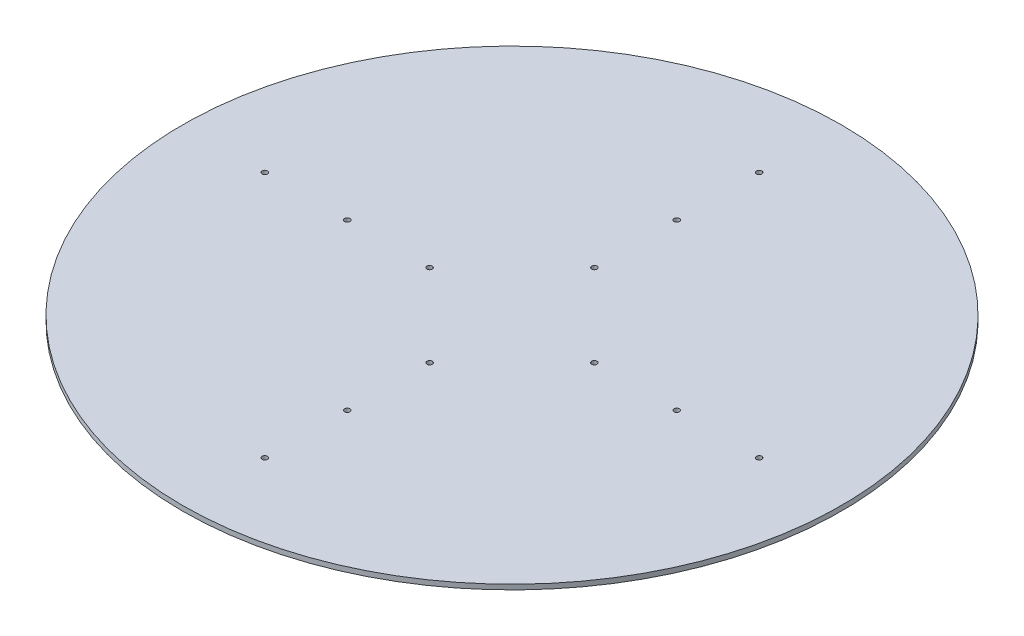
ISO-10303-21;
HEADER;
FILE_DESCRIPTION(('STEP AP214'),'2;1');
FILE_NAME('part.step','',(''),(''),'','','');
FILE_SCHEMA(('AUTOMOTIVE_DESIGN { 1 0 10303 214 1 1 1 1 }'));
ENDSEC;
DATA;
#1=APPLICATION_CONTEXT('core data for automotive mechanical design processes');
#2=APPLICATION_PROTOCOL_DEFINITION('international standard','automotive_design',2000,#1);
#3=PRODUCT_CONTEXT('',#1,'mechanical');
#4=PRODUCT('Part','Part','',(#3));
#5=PRODUCT_RELATED_PRODUCT_CATEGORY('part','',(#4));
#6=PRODUCT_DEFINITION_FORMATION('','',#4);
#7=PRODUCT_DEFINITION_CONTEXT('part definition',#1,'design');
#8=PRODUCT_DEFINITION('design','',#6,#7);
#9=PRODUCT_DEFINITION_SHAPE('','',#8);
#10=(LENGTH_UNIT() NAMED_UNIT(*) SI_UNIT(.MILLI.,.METRE.));
#11=(NAMED_UNIT(*) PLANE_ANGLE_UNIT() SI_UNIT($,.RADIAN.));
#12=(NAMED_UNIT(*) SI_UNIT($,.STERADIAN.) SOLID_ANGLE_UNIT());
#13=UNCERTAINTY_MEASURE_WITH_UNIT(LENGTH_MEASURE(1.E-05),#10,'distance_accuracy_value','');
#14=(GEOMETRIC_REPRESENTATION_CONTEXT(3) GLOBAL_UNCERTAINTY_ASSIGNED_CONTEXT((#13)) GLOBAL_UNIT_ASSIGNED_CONTEXT((#10,
#11,#12)) REPRESENTATION_CONTEXT('',''));
#15=CARTESIAN_POINT('',(0.,0.,0.));
#16=DIRECTION('',(0.,0.,1.));
#17=DIRECTION('',(1.,0.,0.));
#18=AXIS2_PLACEMENT_3D('',#15,#16,#17);
#19=CARTESIAN_POINT('',(0.,-3.,0.));
#20=DIRECTION('',(0.,1.,0.));
#21=DIRECTION('',(0.,0.,1.));
#22=AXIS2_PLACEMENT_3D('',#19,#20,#21);
#23=CYLINDRICAL_SURFACE('',#22,200.);
#24=CARTESIAN_POINT('',(0.,-3.,0.));
#25=DIRECTION('',(0.,1.,0.));
#26=DIRECTION('',(0.,0.,1.));
#27=AXIS2_PLACEMENT_3D('',#24,#25,#26);
#28=CIRCLE('',#27,200.);
#29=CARTESIAN_POINT('',(0.,-3.,200.));
#30=VERTEX_POINT('',#29);
#31=EDGE_CURVE('E10',#30,#30,#28,.T.);
#32=ORIENTED_EDGE('',*,*,#31,.T.);
#33=EDGE_LOOP('',(#32));
#34=FACE_BOUND('',#33,.T.);
#35=CARTESIAN_POINT('',(0.,0.,0.));
#36=DIRECTION('',(0.,1.,0.));
#37=DIRECTION('',(0.,0.,1.));
#38=AXIS2_PLACEMENT_3D('',#35,#36,#37);
#39=CIRCLE('',#38,200.);
#40=CARTESIAN_POINT('',(0.,0.,200.));
#41=VERTEX_POINT('',#40);
#42=EDGE_CURVE('E46',#41,#41,#39,.T.);
#43=ORIENTED_EDGE('',*,*,#42,.F.);
#44=EDGE_LOOP('',(#43));
#45=FACE_BOUND('',#44,.T.);
#46=ADVANCED_FACE('F43',(#34,#45),#23,.T.);
#47=CARTESIAN_POINT('',(0.,-3.,0.));
#48=DIRECTION('',(0.,1.,0.));
#49=DIRECTION('',(0.,0.,1.));
#50=AXIS2_PLACEMENT_3D('',#47,#48,#49);
#51=PLANE('',#50);
#52=CARTESIAN_POINT('',(0.,-3.,-150.));
#53=DIRECTION('',(0.,1.,0.));
#54=DIRECTION('',(0.,0.,1.));
#55=AXIS2_PLACEMENT_3D('',#52,#53,#54);
#56=CIRCLE('',#55,1.63195);
#57=CARTESIAN_POINT('',(0.,-3.,-148.36805));
#58=VERTEX_POINT('',#57);
#59=EDGE_CURVE('E120',#58,#58,#56,.T.);
#60=ORIENTED_EDGE('',*,*,#59,.T.);
#61=EDGE_LOOP('',(#60));
#62=FACE_BOUND('',#61,.T.);
#63=CARTESIAN_POINT('',(0.,-3.,-100.));
#64=DIRECTION('',(0.,1.,0.));
#65=DIRECTION('',(0.,0.,1.));
#66=AXIS2_PLACEMENT_3D('',#63,#64,#65);
#67=CIRCLE('',#66,1.63195);
#68=CARTESIAN_POINT('',(0.,-3.,-98.36805));
#69=VERTEX_POINT('',#68);
#70=EDGE_CURVE('E114',#69,#69,#67,.T.);
#71=ORIENTED_EDGE('',*,*,#70,.T.);
#72=EDGE_LOOP('',(#71));
#73=FACE_BOUND('',#72,.T.);
#74=CARTESIAN_POINT('',(0.,-3.,-50.));
#75=DIRECTION('',(0.,1.,0.));
#76=DIRECTION('',(0.,0.,1.));
#77=AXIS2_PLACEMENT_3D('',#74,#75,#76);
#78=CIRCLE('',#77,1.63195);
#79=CARTESIAN_POINT('',(0.,-3.,-48.36805));
#80=VERTEX_POINT('',#79);
#81=EDGE_CURVE('E108',#80,#80,#78,.T.);
#82=ORIENTED_EDGE('',*,*,#81,.T.);
#83=EDGE_LOOP('',(#82));
#84=FACE_BOUND('',#83,.T.);
#85=CARTESIAN_POINT('',(50.,-3.,1.74574066942157E-13));
#86=DIRECTION('',(0.,1.,0.));
#87=DIRECTION('',(0.,0.,1.));
#88=AXIS2_PLACEMENT_3D('',#85,#86,#87);
#89=CIRCLE('',#88,1.63195);
#90=CARTESIAN_POINT('',(50.,-3.,1.63195000000017));
#91=VERTEX_POINT('',#90);
#92=EDGE_CURVE('E102',#91,#91,#89,.T.);
#93=ORIENTED_EDGE('',*,*,#92,.T.);
#94=EDGE_LOOP('',(#93));
#95=FACE_BOUND('',#94,.T.);
#96=CARTESIAN_POINT('',(100.,-3.,3.49148133884313E-13));
#97=DIRECTION('',(0.,1.,0.));
#98=DIRECTION('',(0.,0.,1.));
#99=AXIS2_PLACEMENT_3D('',#96,#97,#98);
#100=CIRCLE('',#99,1.63194999999999);
#101=CARTESIAN_POINT('',(100.,-3.,1.63195000000034));
#102=VERTEX_POINT('',#101);
#103=EDGE_CURVE('E96',#102,#102,#100,.T.);
#104=ORIENTED_EDGE('',*,*,#103,.T.);
#105=EDGE_LOOP('',(#104));
#106=FACE_BOUND('',#105,.T.);
#107=CARTESIAN_POINT('',(150.,-3.,5.2372220082647E-13));
#108=DIRECTION('',(0.,1.,0.));
#109=DIRECTION('',(0.,0.,1.));
#110=AXIS2_PLACEMENT_3D('',#107,#108,#109);
#111=CIRCLE('',#110,1.63194999999999);
#112=CARTESIAN_POINT('',(150.,-3.,1.63195000000052));
#113=VERTEX_POINT('',#112);
#114=EDGE_CURVE('E90',#113,#113,#111,.T.);
#115=ORIENTED_EDGE('',*,*,#114,.T.);
#116=EDGE_LOOP('',(#115));
#117=FACE_BOUND('',#116,.T.);
#118=CARTESIAN_POINT('',(-3.49148133884313E-13,-3.,50.));
#119=DIRECTION('',(0.,1.,0.));
#120=DIRECTION('',(0.,0.,1.));
#121=AXIS2_PLACEMENT_3D('',#118,#119,#120);
#122=CIRCLE('',#121,1.63195);
#123=CARTESIAN_POINT('',(-3.49148133884313E-13,-3.,51.63195));
#124=VERTEX_POINT('',#123);
#125=EDGE_CURVE('E84',#124,#124,#122,.T.);
#126=ORIENTED_EDGE('',*,*,#125,.T.);
#127=EDGE_LOOP('',(#126));
#128=FACE_BOUND('',#127,.T.);
#129=CARTESIAN_POINT('',(-6.98296267768627E-13,-3.,100.));
#130=DIRECTION('',(0.,1.,0.));
#131=DIRECTION('',(0.,0.,1.));
#132=AXIS2_PLACEMENT_3D('',#129,#130,#131);
#133=CIRCLE('',#132,1.63195);
#134=CARTESIAN_POINT('',(-6.98296267768627E-13,-3.,101.63195));
#135=VERTEX_POINT('',#134);
#136=EDGE_CURVE('E78',#135,#135,#133,.T.);
#137=ORIENTED_EDGE('',*,*,#136,.T.);
#138=EDGE_LOOP('',(#137));
#139=FACE_BOUND('',#138,.T.);
#140=CARTESIAN_POINT('',(-1.04744440165294E-12,-3.,150.));
#141=DIRECTION('',(0.,1.,0.));
#142=DIRECTION('',(0.,0.,1.));
#143=AXIS2_PLACEMENT_3D('',#140,#141,#142);
#144=CIRCLE('',#143,1.63195);
#145=CARTESIAN_POINT('',(-1.04744440165294E-12,-3.,151.63195));
#146=VERTEX_POINT('',#145);
#147=EDGE_CURVE('E72',#146,#146,#144,.T.);
#148=ORIENTED_EDGE('',*,*,#147,.T.);
#149=EDGE_LOOP('',(#148));
#150=FACE_BOUND('',#149,.T.);
#151=CARTESIAN_POINT('',(-50.,-3.,-5.2372220082647E-13));
#152=DIRECTION('',(0.,1.,0.));
#153=DIRECTION('',(0.,0.,1.));
#154=AXIS2_PLACEMENT_3D('',#151,#152,#153);
#155=CIRCLE('',#154,1.63195);
#156=CARTESIAN_POINT('',(-50.,-3.,1.63194999999948));
#157=VERTEX_POINT('',#156);
#158=EDGE_CURVE('E66',#157,#157,#155,.T.);
#159=ORIENTED_EDGE('',*,*,#158,.T.);
#160=EDGE_LOOP('',(#159));
#161=FACE_BOUND('',#160,.T.);
#162=CARTESIAN_POINT('',(-100.,-3.,-1.04744440165294E-12));
#163=DIRECTION('',(0.,1.,0.));
#164=DIRECTION('',(0.,0.,1.));
#165=AXIS2_PLACEMENT_3D('',#162,#163,#164);
#166=CIRCLE('',#165,1.63194999999999);
#167=CARTESIAN_POINT('',(-100.,-3.,1.63194999999895));
#168=VERTEX_POINT('',#167);
#169=EDGE_CURVE('E60',#168,#168,#166,.T.);
#170=ORIENTED_EDGE('',*,*,#169,.T.);
#171=EDGE_LOOP('',(#170));
#172=FACE_BOUND('',#171,.T.);
#173=CARTESIAN_POINT('',(-150.,-3.,-1.57116660247941E-12));
#174=DIRECTION('',(0.,1.,0.));
#175=DIRECTION('',(0.,0.,1.));
#176=AXIS2_PLACEMENT_3D('',#173,#174,#175);
#177=CIRCLE('',#176,1.63194999999999);
#178=CARTESIAN_POINT('',(-150.,-3.,1.63194999999842));
#179=VERTEX_POINT('',#178);
#180=EDGE_CURVE('E53',#179,#179,#177,.T.);
#181=ORIENTED_EDGE('',*,*,#180,.T.);
#182=EDGE_LOOP('',(#181));
#183=FACE_BOUND('',#182,.T.);
#184=ORIENTED_EDGE('',*,*,#31,.F.);
#185=EDGE_LOOP('',(#184));
#186=FACE_BOUND('',#185,.T.);
#187=ADVANCED_FACE('F133',(#62,#73,#84,#95,#106,#117,#128,#139,#150,#161,#172,#183,#186),#51,.F.);
#188=CARTESIAN_POINT('',(0.,0.,0.));
#189=DIRECTION('',(0.,1.,0.));
#190=DIRECTION('',(0.,0.,1.));
#191=AXIS2_PLACEMENT_3D('',#188,#189,#190);
#192=PLANE('',#191);
#193=CARTESIAN_POINT('',(0.,0.,-150.));
#194=DIRECTION('',(0.,1.,0.));
#195=DIRECTION('',(0.,0.,1.));
#196=AXIS2_PLACEMENT_3D('',#193,#194,#195);
#197=CIRCLE('',#196,1.63195);
#198=CARTESIAN_POINT('',(0.,0.,-148.36805));
#199=VERTEX_POINT('',#198);
#200=EDGE_CURVE('E123',#199,#199,#197,.T.);
#201=ORIENTED_EDGE('',*,*,#200,.F.);
#202=EDGE_LOOP('',(#201));
#203=FACE_BOUND('',#202,.T.);
#204=CARTESIAN_POINT('',(0.,0.,-100.));
#205=DIRECTION('',(0.,1.,0.));
#206=DIRECTION('',(0.,0.,1.));
#207=AXIS2_PLACEMENT_3D('',#204,#205,#206);
#208=CIRCLE('',#207,1.63195);
#209=CARTESIAN_POINT('',(0.,0.,-98.36805));
#210=VERTEX_POINT('',#209);
#211=EDGE_CURVE('E117',#210,#210,#208,.T.);
#212=ORIENTED_EDGE('',*,*,#211,.F.);
#213=EDGE_LOOP('',(#212));
#214=FACE_BOUND('',#213,.T.);
#215=CARTESIAN_POINT('',(0.,0.,-50.));
#216=DIRECTION('',(0.,1.,0.));
#217=DIRECTION('',(0.,0.,1.));
#218=AXIS2_PLACEMENT_3D('',#215,#216,#217);
#219=CIRCLE('',#218,1.63195);
#220=CARTESIAN_POINT('',(0.,0.,-48.36805));
#221=VERTEX_POINT('',#220);
#222=EDGE_CURVE('E111',#221,#221,#219,.T.);
#223=ORIENTED_EDGE('',*,*,#222,.F.);
#224=EDGE_LOOP('',(#223));
#225=FACE_BOUND('',#224,.T.);
#226=CARTESIAN_POINT('',(50.,0.,1.74574066942157E-13));
#227=DIRECTION('',(0.,1.,0.));
#228=DIRECTION('',(0.,0.,1.));
#229=AXIS2_PLACEMENT_3D('',#226,#227,#228);
#230=CIRCLE('',#229,1.63195);
#231=CARTESIAN_POINT('',(50.,0.,1.63195000000017));
#232=VERTEX_POINT('',#231);
#233=EDGE_CURVE('E105',#232,#232,#230,.T.);
#234=ORIENTED_EDGE('',*,*,#233,.F.);
#235=EDGE_LOOP('',(#234));
#236=FACE_BOUND('',#235,.T.);
#237=CARTESIAN_POINT('',(100.,0.,3.49148133884313E-13));
#238=DIRECTION('',(0.,1.,0.));
#239=DIRECTION('',(0.,0.,1.));
#240=AXIS2_PLACEMENT_3D('',#237,#238,#239);
#241=CIRCLE('',#240,1.63194999999999);
#242=CARTESIAN_POINT('',(100.,0.,1.63195000000034));
#243=VERTEX_POINT('',#242);
#244=EDGE_CURVE('E99',#243,#243,#241,.T.);
#245=ORIENTED_EDGE('',*,*,#244,.F.);
#246=EDGE_LOOP('',(#245));
#247=FACE_BOUND('',#246,.T.);
#248=CARTESIAN_POINT('',(150.,0.,5.2372220082647E-13));
#249=DIRECTION('',(0.,1.,0.));
#250=DIRECTION('',(0.,0.,1.));
#251=AXIS2_PLACEMENT_3D('',#248,#249,#250);
#252=CIRCLE('',#251,1.63194999999999);
#253=CARTESIAN_POINT('',(150.,0.,1.63195000000052));
#254=VERTEX_POINT('',#253);
#255=EDGE_CURVE('E93',#254,#254,#252,.T.);
#256=ORIENTED_EDGE('',*,*,#255,.F.);
#257=EDGE_LOOP('',(#256));
#258=FACE_BOUND('',#257,.T.);
#259=CARTESIAN_POINT('',(-3.49148133884313E-13,0.,50.));
#260=DIRECTION('',(0.,1.,0.));
#261=DIRECTION('',(0.,0.,1.));
#262=AXIS2_PLACEMENT_3D('',#259,#260,#261);
#263=CIRCLE('',#262,1.63195);
#264=CARTESIAN_POINT('',(-3.49148133884313E-13,0.,51.63195));
#265=VERTEX_POINT('',#264);
#266=EDGE_CURVE('E87',#265,#265,#263,.T.);
#267=ORIENTED_EDGE('',*,*,#266,.F.);
#268=EDGE_LOOP('',(#267));
#269=FACE_BOUND('',#268,.T.);
#270=CARTESIAN_POINT('',(-6.98296267768627E-13,0.,100.));
#271=DIRECTION('',(0.,1.,0.));
#272=DIRECTION('',(0.,0.,1.));
#273=AXIS2_PLACEMENT_3D('',#270,#271,#272);
#274=CIRCLE('',#273,1.63195);
#275=CARTESIAN_POINT('',(-6.98296267768627E-13,0.,101.63195));
#276=VERTEX_POINT('',#275);
#277=EDGE_CURVE('E81',#276,#276,#274,.T.);
#278=ORIENTED_EDGE('',*,*,#277,.F.);
#279=EDGE_LOOP('',(#278));
#280=FACE_BOUND('',#279,.T.);
#281=CARTESIAN_POINT('',(-1.04744440165294E-12,0.,150.));
#282=DIRECTION('',(0.,1.,0.));
#283=DIRECTION('',(0.,0.,1.));
#284=AXIS2_PLACEMENT_3D('',#281,#282,#283);
#285=CIRCLE('',#284,1.63195);
#286=CARTESIAN_POINT('',(-1.04744440165294E-12,0.,151.63195));
#287=VERTEX_POINT('',#286);
#288=EDGE_CURVE('E75',#287,#287,#285,.T.);
#289=ORIENTED_EDGE('',*,*,#288,.F.);
#290=EDGE_LOOP('',(#289));
#291=FACE_BOUND('',#290,.T.);
#292=CARTESIAN_POINT('',(-50.,0.,-5.2372220082647E-13));
#293=DIRECTION('',(0.,1.,0.));
#294=DIRECTION('',(0.,0.,1.));
#295=AXIS2_PLACEMENT_3D('',#292,#293,#294);
#296=CIRCLE('',#295,1.63195);
#297=CARTESIAN_POINT('',(-50.,0.,1.63194999999948));
#298=VERTEX_POINT('',#297);
#299=EDGE_CURVE('E69',#298,#298,#296,.T.);
#300=ORIENTED_EDGE('',*,*,#299,.F.);
#301=EDGE_LOOP('',(#300));
#302=FACE_BOUND('',#301,.T.);
#303=CARTESIAN_POINT('',(-100.,0.,-1.04744440165294E-12));
#304=DIRECTION('',(0.,1.,0.));
#305=DIRECTION('',(0.,0.,1.));
#306=AXIS2_PLACEMENT_3D('',#303,#304,#305);
#307=CIRCLE('',#306,1.63194999999999);
#308=CARTESIAN_POINT('',(-100.,0.,1.63194999999895));
#309=VERTEX_POINT('',#308);
#310=EDGE_CURVE('E63',#309,#309,#307,.T.);
#311=ORIENTED_EDGE('',*,*,#310,.F.);
#312=EDGE_LOOP('',(#311));
#313=FACE_BOUND('',#312,.T.);
#314=CARTESIAN_POINT('',(-150.,0.,-1.57116660247941E-12));
#315=DIRECTION('',(0.,1.,0.));
#316=DIRECTION('',(0.,0.,1.));
#317=AXIS2_PLACEMENT_3D('',#314,#315,#316);
#318=CIRCLE('',#317,1.63194999999999);
#319=CARTESIAN_POINT('',(-150.,0.,1.63194999999842));
#320=VERTEX_POINT('',#319);
#321=EDGE_CURVE('E57',#320,#320,#318,.T.);
#322=ORIENTED_EDGE('',*,*,#321,.F.);
#323=EDGE_LOOP('',(#322));
#324=FACE_BOUND('',#323,.T.);
#325=ORIENTED_EDGE('',*,*,#42,.T.);
#326=EDGE_LOOP('',(#325));
#327=FACE_BOUND('',#326,.T.);
#328=ADVANCED_FACE('F129',(#203,#214,#225,#236,#247,#258,#269,#280,#291,#302,#313,#324,#327),
#192,.T.);
#329=CARTESIAN_POINT('',(-150.,0.,-1.57116660247941E-12));
#330=DIRECTION('',(0.,1.,0.));
#331=DIRECTION('',(0.,0.,1.));
#332=AXIS2_PLACEMENT_3D('',#329,#330,#331);
#333=CYLINDRICAL_SURFACE('',#332,1.63194999999999);
#334=ORIENTED_EDGE('',*,*,#180,.F.);
#335=EDGE_LOOP('',(#334));
#336=FACE_BOUND('',#335,.T.);
#337=ORIENTED_EDGE('',*,*,#321,.T.);
#338=EDGE_LOOP('',(#337));
#339=FACE_BOUND('',#338,.T.);
#340=ADVANCED_FACE('F132',(#336,#339),#333,.F.);
#341=CARTESIAN_POINT('',(-100.,0.,-1.04744440165294E-12));
#342=DIRECTION('',(0.,1.,0.));
#343=DIRECTION('',(0.,0.,1.));
#344=AXIS2_PLACEMENT_3D('',#341,#342,#343);
#345=CYLINDRICAL_SURFACE('',#344,1.63194999999999);
#346=ORIENTED_EDGE('',*,*,#169,.F.);
#347=EDGE_LOOP('',(#346));
#348=FACE_BOUND('',#347,.T.);
#349=ORIENTED_EDGE('',*,*,#310,.T.);
#350=EDGE_LOOP('',(#349));
#351=FACE_BOUND('',#350,.T.);
#352=ADVANCED_FACE('F170',(#348,#351),#345,.F.);
#353=CARTESIAN_POINT('',(-50.,0.,-5.2372220082647E-13));
#354=DIRECTION('',(0.,1.,0.));
#355=DIRECTION('',(0.,0.,1.));
#356=AXIS2_PLACEMENT_3D('',#353,#354,#355);
#357=CYLINDRICAL_SURFACE('',#356,1.63195);
#358=ORIENTED_EDGE('',*,*,#158,.F.);
#359=EDGE_LOOP('',(#358));
#360=FACE_BOUND('',#359,.T.);
#361=ORIENTED_EDGE('',*,*,#299,.T.);
#362=EDGE_LOOP('',(#361));
#363=FACE_BOUND('',#362,.T.);
#364=ADVANCED_FACE('F174',(#360,#363),#357,.F.);
#365=CARTESIAN_POINT('',(-1.04744440165294E-12,0.,150.));
#366=DIRECTION('',(0.,1.,0.));
#367=DIRECTION('',(0.,0.,1.));
#368=AXIS2_PLACEMENT_3D('',#365,#366,#367);
#369=CYLINDRICAL_SURFACE('',#368,1.63195);
#370=ORIENTED_EDGE('',*,*,#147,.F.);
#371=EDGE_LOOP('',(#370));
#372=FACE_BOUND('',#371,.T.);
#373=ORIENTED_EDGE('',*,*,#288,.T.);
#374=EDGE_LOOP('',(#373));
#375=FACE_BOUND('',#374,.T.);
#376=ADVANCED_FACE('F178',(#372,#375),#369,.F.);
#377=CARTESIAN_POINT('',(-6.98296267768627E-13,0.,100.));
#378=DIRECTION('',(0.,1.,0.));
#379=DIRECTION('',(0.,0.,1.));
#380=AXIS2_PLACEMENT_3D('',#377,#378,#379);
#381=CYLINDRICAL_SURFACE('',#380,1.63195);
#382=ORIENTED_EDGE('',*,*,#136,.F.);
#383=EDGE_LOOP('',(#382));
#384=FACE_BOUND('',#383,.T.);
#385=ORIENTED_EDGE('',*,*,#277,.T.);
#386=EDGE_LOOP('',(#385));
#387=FACE_BOUND('',#386,.T.);
#388=ADVANCED_FACE('F182',(#384,#387),#381,.F.);
#389=CARTESIAN_POINT('',(-3.49148133884313E-13,0.,50.));
#390=DIRECTION('',(0.,1.,0.));
#391=DIRECTION('',(0.,0.,1.));
#392=AXIS2_PLACEMENT_3D('',#389,#390,#391);
#393=CYLINDRICAL_SURFACE('',#392,1.63195);
#394=ORIENTED_EDGE('',*,*,#125,.F.);
#395=EDGE_LOOP('',(#394));
#396=FACE_BOUND('',#395,.T.);
#397=ORIENTED_EDGE('',*,*,#266,.T.);
#398=EDGE_LOOP('',(#397));
#399=FACE_BOUND('',#398,.T.);
#400=ADVANCED_FACE('F186',(#396,#399),#393,.F.);
#401=CARTESIAN_POINT('',(150.,0.,5.2372220082647E-13));
#402=DIRECTION('',(0.,1.,0.));
#403=DIRECTION('',(0.,0.,1.));
#404=AXIS2_PLACEMENT_3D('',#401,#402,#403);
#405=CYLINDRICAL_SURFACE('',#404,1.63194999999999);
#406=ORIENTED_EDGE('',*,*,#114,.F.);
#407=EDGE_LOOP('',(#406));
#408=FACE_BOUND('',#407,.T.);
#409=ORIENTED_EDGE('',*,*,#255,.T.);
#410=EDGE_LOOP('',(#409));
#411=FACE_BOUND('',#410,.T.);
#412=ADVANCED_FACE('F190',(#408,#411),#405,.F.);
#413=CARTESIAN_POINT('',(100.,0.,3.49148133884313E-13));
#414=DIRECTION('',(0.,1.,0.));
#415=DIRECTION('',(0.,0.,1.));
#416=AXIS2_PLACEMENT_3D('',#413,#414,#415);
#417=CYLINDRICAL_SURFACE('',#416,1.63194999999999);
#418=ORIENTED_EDGE('',*,*,#103,.F.);
#419=EDGE_LOOP('',(#418));
#420=FACE_BOUND('',#419,.T.);
#421=ORIENTED_EDGE('',*,*,#244,.T.);
#422=EDGE_LOOP('',(#421));
#423=FACE_BOUND('',#422,.T.);
#424=ADVANCED_FACE('F194',(#420,#423),#417,.F.);
#425=CARTESIAN_POINT('',(50.,0.,1.74574066942157E-13));
#426=DIRECTION('',(0.,1.,0.));
#427=DIRECTION('',(0.,0.,1.));
#428=AXIS2_PLACEMENT_3D('',#425,#426,#427);
#429=CYLINDRICAL_SURFACE('',#428,1.63195);
#430=ORIENTED_EDGE('',*,*,#92,.F.);
#431=EDGE_LOOP('',(#430));
#432=FACE_BOUND('',#431,.T.);
#433=ORIENTED_EDGE('',*,*,#233,.T.);
#434=EDGE_LOOP('',(#433));
#435=FACE_BOUND('',#434,.T.);
#436=ADVANCED_FACE('F198',(#432,#435),#429,.F.);
#437=CARTESIAN_POINT('',(0.,0.,-50.));
#438=DIRECTION('',(0.,1.,0.));
#439=DIRECTION('',(0.,0.,1.));
#440=AXIS2_PLACEMENT_3D('',#437,#438,#439);
#441=CYLINDRICAL_SURFACE('',#440,1.63195);
#442=ORIENTED_EDGE('',*,*,#81,.F.);
#443=EDGE_LOOP('',(#442));
#444=FACE_BOUND('',#443,.T.);
#445=ORIENTED_EDGE('',*,*,#222,.T.);
#446=EDGE_LOOP('',(#445));
#447=FACE_BOUND('',#446,.T.);
#448=ADVANCED_FACE('F202',(#444,#447),#441,.F.);
#449=CARTESIAN_POINT('',(0.,0.,-100.));
#450=DIRECTION('',(0.,1.,0.));
#451=DIRECTION('',(0.,0.,1.));
#452=AXIS2_PLACEMENT_3D('',#449,#450,#451);
#453=CYLINDRICAL_SURFACE('',#452,1.63195);
#454=ORIENTED_EDGE('',*,*,#70,.F.);
#455=EDGE_LOOP('',(#454));
#456=FACE_BOUND('',#455,.T.);
#457=ORIENTED_EDGE('',*,*,#211,.T.);
#458=EDGE_LOOP('',(#457));
#459=FACE_BOUND('',#458,.T.);
#460=ADVANCED_FACE('F206',(#456,#459),#453,.F.);
#461=CARTESIAN_POINT('',(0.,0.,-150.));
#462=DIRECTION('',(0.,1.,0.));
#463=DIRECTION('',(0.,0.,1.));
#464=AXIS2_PLACEMENT_3D('',#461,#462,#463);
#465=CYLINDRICAL_SURFACE('',#464,1.63195);
#466=ORIENTED_EDGE('',*,*,#59,.F.);
#467=EDGE_LOOP('',(#466));
#468=FACE_BOUND('',#467,.T.);
#469=ORIENTED_EDGE('',*,*,#200,.T.);
#470=EDGE_LOOP('',(#469));
#471=FACE_BOUND('',#470,.T.);
#472=ADVANCED_FACE('F127',(#468,#471),#465,.F.);
#473=CLOSED_SHELL('',(#46,#187,#328,#340,#352,#364,#376,#388,#400,#412,#424,#436,#448,#460,#472));
#474=MANIFOLD_SOLID_BREP('B2',#473);
#475=ADVANCED_BREP_SHAPE_REPRESENTATION('',(#18,#474),#14);
#476=SHAPE_DEFINITION_REPRESENTATION(#9,#475);
ENDSEC;
END-ISO-10303-21;
